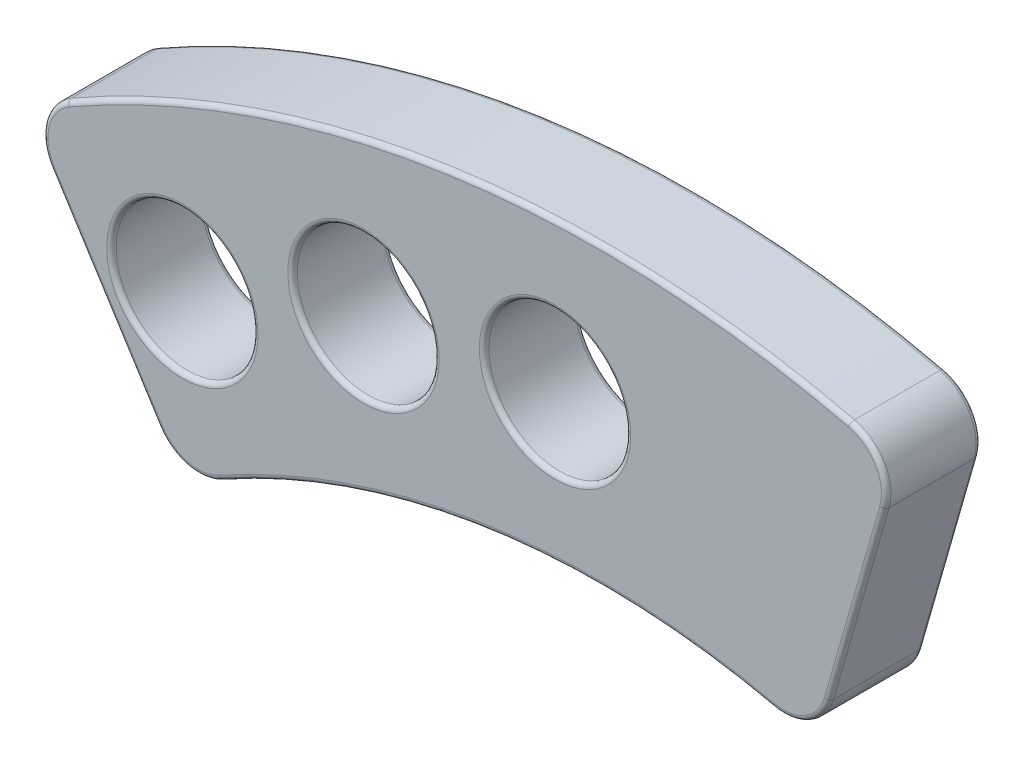
ISO-10303-21;
HEADER;
FILE_DESCRIPTION(('STEP AP214'),'2;1');
FILE_NAME('part.step','',(''),(''),'','','');
FILE_SCHEMA(('AUTOMOTIVE_DESIGN { 1 0 10303 214 1 1 1 1 }'));
ENDSEC;
DATA;
#1=APPLICATION_CONTEXT('core data for automotive mechanical design processes');
#2=APPLICATION_PROTOCOL_DEFINITION('international standard','automotive_design',2000,#1);
#3=PRODUCT_CONTEXT('',#1,'mechanical');
#4=PRODUCT('Part','Part','',(#3));
#5=PRODUCT_RELATED_PRODUCT_CATEGORY('part','',(#4));
#6=PRODUCT_DEFINITION_FORMATION('','',#4);
#7=PRODUCT_DEFINITION_CONTEXT('part definition',#1,'design');
#8=PRODUCT_DEFINITION('design','',#6,#7);
#9=PRODUCT_DEFINITION_SHAPE('','',#8);
#10=(LENGTH_UNIT() NAMED_UNIT(*) SI_UNIT(.MILLI.,.METRE.));
#11=(NAMED_UNIT(*) PLANE_ANGLE_UNIT() SI_UNIT($,.RADIAN.));
#12=(NAMED_UNIT(*) SI_UNIT($,.STERADIAN.) SOLID_ANGLE_UNIT());
#13=UNCERTAINTY_MEASURE_WITH_UNIT(LENGTH_MEASURE(1.E-05),#10,'distance_accuracy_value','');
#14=(GEOMETRIC_REPRESENTATION_CONTEXT(3) GLOBAL_UNCERTAINTY_ASSIGNED_CONTEXT((#13)) GLOBAL_UNIT_ASSIGNED_CONTEXT((#10,
#11,#12)) REPRESENTATION_CONTEXT('',''));
#15=CARTESIAN_POINT('',(0.,0.,0.));
#16=DIRECTION('',(0.,0.,1.));
#17=DIRECTION('',(1.,0.,0.));
#18=AXIS2_PLACEMENT_3D('',#15,#16,#17);
#19=CARTESIAN_POINT('',(0.,0.,4.));
#20=DIRECTION('',(-0.961340958485753,0.275360784313404,0.));
#21=DIRECTION('',(-0.275360784313404,-0.961340958485753,0.));
#22=AXIS2_PLACEMENT_3D('',#19,#20,#21);
#23=PLANE('',#22);
#24=DIRECTION('',(0.,0.,-1.));
#25=VECTOR('',#24,1.);
#26=CARTESIAN_POINT('',(11.9665954579187,41.7778383948582,4.));
#27=LINE('',#26,#25);
#28=CARTESIAN_POINT('',(11.9665954579187,41.7778383948582,3.8));
#29=VERTEX_POINT('',#28);
#30=CARTESIAN_POINT('',(11.9665954579187,41.7778383948582,0.2));
#31=VERTEX_POINT('',#30);
#32=EDGE_CURVE('E321',#29,#31,#27,.T.);
#33=ORIENTED_EDGE('',*,*,#32,.F.);
#34=DIRECTION('',(0.275360784313404,0.961340958485753,0.));
#35=VECTOR('',#34,1.);
#36=CARTESIAN_POINT('',(9.62294157756633,33.5956621517354,3.8));
#37=LINE('',#36,#35);
#38=CARTESIAN_POINT('',(9.62294157756633,33.5956621517354,3.8));
#39=VERTEX_POINT('',#38);
#40=EDGE_CURVE('E212',#29,#39,#37,.F.);
#41=ORIENTED_EDGE('',*,*,#40,.T.);
#42=DIRECTION('',(0.,0.,-1.));
#43=VECTOR('',#42,1.);
#44=CARTESIAN_POINT('',(9.62294157756633,33.5956621517354,4.));
#45=LINE('',#44,#43);
#46=CARTESIAN_POINT('',(9.62294157756633,33.5956621517354,0.2));
#47=VERTEX_POINT('',#46);
#48=EDGE_CURVE('E270',#39,#47,#45,.T.);
#49=ORIENTED_EDGE('',*,*,#48,.T.);
#50=DIRECTION('',(0.275360784313404,0.961340958485753,0.));
#51=VECTOR('',#50,1.);
#52=CARTESIAN_POINT('',(0.,0.,0.2));
#53=LINE('',#52,#51);
#54=EDGE_CURVE('E210',#47,#31,#53,.T.);
#55=ORIENTED_EDGE('',*,*,#54,.T.);
#56=EDGE_LOOP('',(#33,#41,#49,#55));
#57=FACE_BOUND('',#56,.T.);
#58=ADVANCED_FACE('F37',(#57),#23,.F.);
#59=CARTESIAN_POINT('',(10.0439135409472,42.328559963485,4.));
#60=DIRECTION('',(0.,0.,-1.));
#61=DIRECTION('',(-1.,0.,0.));
#62=AXIS2_PLACEMENT_3D('',#59,#60,#61);
#63=CYLINDRICAL_SURFACE('',#62,2.);
#64=DIRECTION('',(0.,0.,-1.));
#65=VECTOR('',#64,1.);
#66=CARTESIAN_POINT('',(10.5056615307137,44.2745272792297,4.));
#67=LINE('',#66,#65);
#68=CARTESIAN_POINT('',(10.5056615307137,44.2745272792297,3.8));
#69=VERTEX_POINT('',#68);
#70=CARTESIAN_POINT('',(10.5056615307137,44.2745272792297,0.2));
#71=VERTEX_POINT('',#70);
#72=EDGE_CURVE('E329',#69,#71,#67,.T.);
#73=ORIENTED_EDGE('',*,*,#72,.F.);
#74=CARTESIAN_POINT('',(10.0439135409472,42.328559963485,3.8));
#75=DIRECTION('',(0.,0.,1.));
#76=DIRECTION('',(1.,0.,0.));
#77=AXIS2_PLACEMENT_3D('',#74,#75,#76);
#78=CIRCLE('',#77,2.);
#79=EDGE_CURVE('E208',#69,#29,#78,.F.);
#80=ORIENTED_EDGE('',*,*,#79,.T.);
#81=ORIENTED_EDGE('',*,*,#32,.T.);
#82=CARTESIAN_POINT('',(10.0439135409472,42.328559963485,0.2));
#83=DIRECTION('',(0.,0.,1.));
#84=DIRECTION('',(1.,0.,0.));
#85=AXIS2_PLACEMENT_3D('',#82,#83,#84);
#86=CIRCLE('',#85,2.);
#87=EDGE_CURVE('E205',#31,#71,#86,.T.);
#88=ORIENTED_EDGE('',*,*,#87,.T.);
#89=EDGE_LOOP('',(#73,#80,#81,#88));
#90=FACE_BOUND('',#89,.T.);
#91=ADVANCED_FACE('F325',(#90),#63,.T.);
#92=CARTESIAN_POINT('',(0.,0.,4.));
#93=DIRECTION('',(0.,0.,-1.));
#94=DIRECTION('',(-1.,0.,0.));
#95=AXIS2_PLACEMENT_3D('',#92,#93,#94);
#96=CYLINDRICAL_SURFACE('',#95,45.503875549201);
#97=DIRECTION('',(0.,0.,-1.));
#98=VECTOR('',#97,1.);
#99=CARTESIAN_POINT('',(-22.5919266784462,39.4994625117649,4.));
#100=LINE('',#99,#98);
#101=CARTESIAN_POINT('',(-22.5919266784462,39.4994625117649,3.8));
#102=VERTEX_POINT('',#101);
#103=CARTESIAN_POINT('',(-22.5919266784462,39.4994625117649,0.2));
#104=VERTEX_POINT('',#103);
#105=EDGE_CURVE('E334',#102,#104,#100,.T.);
#106=ORIENTED_EDGE('',*,*,#105,.F.);
#107=CARTESIAN_POINT('',(0.,0.,3.8));
#108=DIRECTION('',(0.,0.,1.));
#109=DIRECTION('',(1.,0.,0.));
#110=AXIS2_PLACEMENT_3D('',#107,#108,#109);
#111=CIRCLE('',#110,45.503875549201);
#112=EDGE_CURVE('E203',#102,#69,#111,.F.);
#113=ORIENTED_EDGE('',*,*,#112,.T.);
#114=ORIENTED_EDGE('',*,*,#72,.T.);
#115=CARTESIAN_POINT('',(0.,0.,0.2));
#116=DIRECTION('',(0.,0.,1.));
#117=DIRECTION('',(1.,0.,0.));
#118=AXIS2_PLACEMENT_3D('',#115,#116,#117);
#119=CIRCLE('',#118,45.503875549201);
#120=EDGE_CURVE('E201',#71,#104,#119,.T.);
#121=ORIENTED_EDGE('',*,*,#120,.T.);
#122=EDGE_LOOP('',(#106,#113,#114,#121));
#123=FACE_BOUND('',#122,.T.);
#124=ADVANCED_FACE('F411',(#123),#96,.T.);
#125=CARTESIAN_POINT('',(-21.5990457137188,37.7633209881897,4.));
#126=DIRECTION('',(0.,0.,-1.));
#127=DIRECTION('',(-1.,0.,0.));
#128=AXIS2_PLACEMENT_3D('',#125,#126,#127);
#129=CYLINDRICAL_SURFACE('',#128,2.);
#130=DIRECTION('',(0.,0.,-1.));
#131=VECTOR('',#130,1.);
#132=CARTESIAN_POINT('',(-23.2877015647229,36.6916673982318,4.));
#133=LINE('',#132,#131);
#134=CARTESIAN_POINT('',(-23.2877015647229,36.6916673982318,3.8));
#135=VERTEX_POINT('',#134);
#136=CARTESIAN_POINT('',(-23.2877015647229,36.6916673982318,0.2));
#137=VERTEX_POINT('',#136);
#138=EDGE_CURVE('E375',#135,#137,#133,.T.);
#139=ORIENTED_EDGE('',*,*,#138,.F.);
#140=CARTESIAN_POINT('',(-21.5990457137188,37.7633209881897,3.8));
#141=DIRECTION('',(0.,0.,1.));
#142=DIRECTION('',(1.,0.,0.));
#143=AXIS2_PLACEMENT_3D('',#140,#141,#142);
#144=CIRCLE('',#143,2.);
#145=EDGE_CURVE('E199',#135,#102,#144,.F.);
#146=ORIENTED_EDGE('',*,*,#145,.T.);
#147=ORIENTED_EDGE('',*,*,#105,.T.);
#148=CARTESIAN_POINT('',(-21.5990457137188,37.7633209881897,0.2));
#149=DIRECTION('',(0.,0.,1.));
#150=DIRECTION('',(1.,0.,0.));
#151=AXIS2_PLACEMENT_3D('',#148,#149,#150);
#152=CIRCLE('',#151,2.);
#153=EDGE_CURVE('E197',#104,#137,#152,.T.);
#154=ORIENTED_EDGE('',*,*,#153,.T.);
#155=EDGE_LOOP('',(#139,#146,#147,#154));
#156=FACE_BOUND('',#155,.T.);
#157=ADVANCED_FACE('F382',(#156),#129,.T.);
#158=CARTESIAN_POINT('',(-0.00175468856194452,-0.00111355922258998,4.));
#159=DIRECTION('',(-0.844327925502016,-0.535826794978996,0.));
#160=DIRECTION('',(0.535826794978996,-0.844327925502016,0.));
#161=AXIS2_PLACEMENT_3D('',#158,#159,#160);
#162=PLANE('',#161);
#163=DIRECTION('',(0.,0.,-1.));
#164=VECTOR('',#163,1.);
#165=CARTESIAN_POINT('',(-18.7271788454364,29.5054334829776,4.));
#166=LINE('',#165,#164);
#167=CARTESIAN_POINT('',(-18.7271788454364,29.5054334829776,3.8));
#168=VERTEX_POINT('',#167);
#169=CARTESIAN_POINT('',(-18.7271788454364,29.5054334829776,0.2));
#170=VERTEX_POINT('',#169);
#171=EDGE_CURVE('E369',#168,#170,#166,.T.);
#172=ORIENTED_EDGE('',*,*,#171,.F.);
#173=DIRECTION('',(-0.535826794978996,0.844327925502016,0.));
#174=VECTOR('',#173,1.);
#175=CARTESIAN_POINT('',(-0.00175468856194452,-0.00111355922258998,3.8));
#176=LINE('',#175,#174);
#177=EDGE_CURVE('E195',#168,#135,#176,.T.);
#178=ORIENTED_EDGE('',*,*,#177,.T.);
#179=ORIENTED_EDGE('',*,*,#138,.T.);
#180=DIRECTION('',(-0.535826794978996,0.844327925502016,0.));
#181=VECTOR('',#180,1.);
#182=CARTESIAN_POINT('',(-18.7271788454364,29.5054334829776,0.2));
#183=LINE('',#182,#181);
#184=EDGE_CURVE('E193',#137,#170,#183,.F.);
#185=ORIENTED_EDGE('',*,*,#184,.T.);
#186=EDGE_LOOP('',(#172,#178,#179,#185));
#187=FACE_BOUND('',#186,.T.);
#188=ADVANCED_FACE('F489',(#187),#162,.T.);
#189=CARTESIAN_POINT('',(-17.0385229944323,30.5770870729356,4.));
#190=DIRECTION('',(0.,0.,-1.));
#191=DIRECTION('',(-1.,0.,0.));
#192=AXIS2_PLACEMENT_3D('',#189,#190,#191);
#193=CYLINDRICAL_SURFACE('',#192,2.);
#194=DIRECTION('',(0.,0.,-1.));
#195=VECTOR('',#194,1.);
#196=CARTESIAN_POINT('',(-16.0651150936589,28.8299531173638,4.));
#197=LINE('',#196,#195);
#198=CARTESIAN_POINT('',(-16.0651150936589,28.8299531173638,3.8));
#199=VERTEX_POINT('',#198);
#200=CARTESIAN_POINT('',(-16.0651150936589,28.8299531173638,0.2));
#201=VERTEX_POINT('',#200);
#202=EDGE_CURVE('E367',#199,#201,#197,.T.);
#203=ORIENTED_EDGE('',*,*,#202,.F.);
#204=CARTESIAN_POINT('',(-17.0385229944323,30.5770870729356,3.8));
#205=DIRECTION('',(0.,0.,1.));
#206=DIRECTION('',(1.,0.,0.));
#207=AXIS2_PLACEMENT_3D('',#204,#205,#206);
#208=CIRCLE('',#207,2.);
#209=EDGE_CURVE('E191',#199,#168,#208,.F.);
#210=ORIENTED_EDGE('',*,*,#209,.T.);
#211=ORIENTED_EDGE('',*,*,#171,.T.);
#212=CARTESIAN_POINT('',(-17.0385229944323,30.5770870729356,0.2));
#213=DIRECTION('',(0.,0.,1.));
#214=DIRECTION('',(1.,0.,0.));
#215=AXIS2_PLACEMENT_3D('',#212,#213,#214);
#216=CIRCLE('',#215,2.);
#217=EDGE_CURVE('E189',#170,#201,#216,.T.);
#218=ORIENTED_EDGE('',*,*,#217,.T.);
#219=EDGE_LOOP('',(#203,#210,#211,#218));
#220=FACE_BOUND('',#219,.T.);
#221=ADVANCED_FACE('F486',(#220),#193,.T.);
#222=CARTESIAN_POINT('',(0.,0.,4.));
#223=DIRECTION('',(0.,0.,-1.));
#224=DIRECTION('',(-1.,0.,0.));
#225=AXIS2_PLACEMENT_3D('',#222,#223,#224);
#226=CYLINDRICAL_SURFACE('',#225,33.0038500742247);
#227=DIRECTION('',(0.,0.,-1.));
#228=VECTOR('',#227,1.);
#229=CARTESIAN_POINT('',(7.26029322008805,32.1953764084262,4.));
#230=LINE('',#229,#228);
#231=CARTESIAN_POINT('',(7.26029322008805,32.1953764084262,3.8));
#232=VERTEX_POINT('',#231);
#233=CARTESIAN_POINT('',(7.26029322008805,32.1953764084262,0.2));
#234=VERTEX_POINT('',#233);
#235=EDGE_CURVE('E365',#232,#234,#230,.T.);
#236=ORIENTED_EDGE('',*,*,#235,.F.);
#237=CARTESIAN_POINT('',(0.,0.,3.8));
#238=DIRECTION('',(0.,0.,1.));
#239=DIRECTION('',(1.,0.,0.));
#240=AXIS2_PLACEMENT_3D('',#237,#238,#239);
#241=CIRCLE('',#240,33.0038500742247);
#242=EDGE_CURVE('E187',#232,#199,#241,.T.);
#243=ORIENTED_EDGE('',*,*,#242,.T.);
#244=ORIENTED_EDGE('',*,*,#202,.T.);
#245=CARTESIAN_POINT('',(0.,0.,0.2));
#246=DIRECTION('',(0.,0.,1.));
#247=DIRECTION('',(1.,0.,0.));
#248=AXIS2_PLACEMENT_3D('',#245,#246,#247);
#249=CIRCLE('',#248,33.0038500742247);
#250=EDGE_CURVE('E185',#201,#234,#249,.F.);
#251=ORIENTED_EDGE('',*,*,#250,.T.);
#252=EDGE_LOOP('',(#236,#243,#244,#251));
#253=FACE_BOUND('',#252,.T.);
#254=ADVANCED_FACE('F366',(#253),#226,.F.);
#255=CARTESIAN_POINT('',(-17.7126467123084,34.9725652470395,4.));
#256=DIRECTION('',(0.,0.,-1.));
#257=DIRECTION('',(-1.,0.,0.));
#258=AXIS2_PLACEMENT_3D('',#255,#256,#257);
#259=CYLINDRICAL_SURFACE('',#258,3.);
#260=CARTESIAN_POINT('',(-17.7126467123084,34.9725652470395,3.8));
#261=DIRECTION('',(0.,0.,1.));
#262=DIRECTION('',(1.,0.,0.));
#263=AXIS2_PLACEMENT_3D('',#260,#261,#262);
#264=CIRCLE('',#263,3.);
#265=CARTESIAN_POINT('',(-14.7126467123084,34.9725652470395,3.8));
#266=VERTEX_POINT('',#265);
#267=EDGE_CURVE('E217',#266,#266,#264,.T.);
#268=ORIENTED_EDGE('',*,*,#267,.T.);
#269=EDGE_LOOP('',(#268));
#270=FACE_BOUND('',#269,.T.);
#271=CARTESIAN_POINT('',(-17.7126467123084,34.9725652470395,0.2));
#272=DIRECTION('',(0.,0.,1.));
#273=DIRECTION('',(1.,0.,0.));
#274=AXIS2_PLACEMENT_3D('',#271,#272,#273);
#275=CIRCLE('',#274,3.);
#276=CARTESIAN_POINT('',(-14.7126467123084,34.9725652470395,0.2));
#277=VERTEX_POINT('',#276);
#278=EDGE_CURVE('E214',#277,#277,#275,.F.);
#279=ORIENTED_EDGE('',*,*,#278,.T.);
#280=EDGE_LOOP('',(#279));
#281=FACE_BOUND('',#280,.T.);
#282=ADVANCED_FACE('F415',(#270,#281),#259,.F.);
#283=CARTESIAN_POINT('',(-10.054377711544,37.8909971147134,4.));
#284=DIRECTION('',(0.,0.,-1.));
#285=DIRECTION('',(-1.,0.,0.));
#286=AXIS2_PLACEMENT_3D('',#283,#284,#285);
#287=CYLINDRICAL_SURFACE('',#286,3.00000000000027);
#288=CARTESIAN_POINT('',(-10.054377711544,37.8909971147134,3.8));
#289=DIRECTION('',(0.,0.,1.));
#290=DIRECTION('',(1.,0.,0.));
#291=AXIS2_PLACEMENT_3D('',#288,#289,#290);
#292=CIRCLE('',#291,3.00000000000027);
#293=CARTESIAN_POINT('',(-7.05437771154368,37.8909971147134,3.8));
#294=VERTEX_POINT('',#293);
#295=EDGE_CURVE('E223',#294,#294,#292,.T.);
#296=ORIENTED_EDGE('',*,*,#295,.T.);
#297=EDGE_LOOP('',(#296));
#298=FACE_BOUND('',#297,.T.);
#299=CARTESIAN_POINT('',(-10.054377711544,37.8909971147134,0.2));
#300=DIRECTION('',(0.,0.,1.));
#301=DIRECTION('',(1.,0.,0.));
#302=AXIS2_PLACEMENT_3D('',#299,#300,#301);
#303=CIRCLE('',#302,3.00000000000027);
#304=CARTESIAN_POINT('',(-7.05437771154368,37.8909971147134,0.2));
#305=VERTEX_POINT('',#304);
#306=EDGE_CURVE('E220',#305,#305,#303,.F.);
#307=ORIENTED_EDGE('',*,*,#306,.T.);
#308=EDGE_LOOP('',(#307));
#309=FACE_BOUND('',#308,.T.);
#310=ADVANCED_FACE('F418',(#298,#309),#287,.F.);
#311=CARTESIAN_POINT('',(-1.95668415852767,39.1534105872975,4.));
#312=DIRECTION('',(0.,0.,-1.));
#313=DIRECTION('',(-1.,0.,0.));
#314=AXIS2_PLACEMENT_3D('',#311,#312,#313);
#315=CYLINDRICAL_SURFACE('',#314,3.00000000000087);
#316=CARTESIAN_POINT('',(-1.95668415852767,39.1534105872975,3.8));
#317=DIRECTION('',(0.,0.,1.));
#318=DIRECTION('',(1.,0.,0.));
#319=AXIS2_PLACEMENT_3D('',#316,#317,#318);
#320=CIRCLE('',#319,3.00000000000087);
#321=CARTESIAN_POINT('',(1.0433158414732,39.1534105872975,3.8));
#322=VERTEX_POINT('',#321);
#323=EDGE_CURVE('E229',#322,#322,#320,.T.);
#324=ORIENTED_EDGE('',*,*,#323,.T.);
#325=EDGE_LOOP('',(#324));
#326=FACE_BOUND('',#325,.T.);
#327=CARTESIAN_POINT('',(-1.95668415852767,39.1534105872975,0.2));
#328=DIRECTION('',(0.,0.,1.));
#329=DIRECTION('',(1.,0.,0.));
#330=AXIS2_PLACEMENT_3D('',#327,#328,#329);
#331=CIRCLE('',#330,3.00000000000087);
#332=CARTESIAN_POINT('',(1.0433158414732,39.1534105872975,0.2));
#333=VERTEX_POINT('',#332);
#334=EDGE_CURVE('E226',#333,#333,#331,.F.);
#335=ORIENTED_EDGE('',*,*,#334,.T.);
#336=EDGE_LOOP('',(#335));
#337=FACE_BOUND('',#336,.T.);
#338=ADVANCED_FACE('F422',(#326,#337),#315,.F.);
#339=CARTESIAN_POINT('',(7.70025966059482,34.1463837203622,4.));
#340=DIRECTION('',(0.,0.,-1.));
#341=DIRECTION('',(-1.,0.,0.));
#342=AXIS2_PLACEMENT_3D('',#339,#340,#341);
#343=CYLINDRICAL_SURFACE('',#342,2.);
#344=ORIENTED_EDGE('',*,*,#48,.F.);
#345=CARTESIAN_POINT('',(7.70025966059482,34.1463837203622,3.8));
#346=DIRECTION('',(0.,0.,1.));
#347=DIRECTION('',(1.,0.,0.));
#348=AXIS2_PLACEMENT_3D('',#345,#346,#347);
#349=CIRCLE('',#348,2.);
#350=EDGE_CURVE('E157',#39,#232,#349,.F.);
#351=ORIENTED_EDGE('',*,*,#350,.T.);
#352=ORIENTED_EDGE('',*,*,#235,.T.);
#353=CARTESIAN_POINT('',(7.70025966059482,34.1463837203622,0.2));
#354=DIRECTION('',(0.,0.,1.));
#355=DIRECTION('',(1.,0.,0.));
#356=AXIS2_PLACEMENT_3D('',#353,#354,#355);
#357=CIRCLE('',#356,2.);
#358=EDGE_CURVE('E177',#234,#47,#357,.T.);
#359=ORIENTED_EDGE('',*,*,#358,.T.);
#360=EDGE_LOOP('',(#344,#351,#352,#359));
#361=FACE_BOUND('',#360,.T.);
#362=ADVANCED_FACE('F364',(#361),#343,.T.);
#363=CARTESIAN_POINT('',(0.,0.,4.));
#364=DIRECTION('',(0.,0.,1.));
#365=DIRECTION('',(1.,0.,0.));
#366=AXIS2_PLACEMENT_3D('',#363,#364,#365);
#367=PLANE('',#366);
#368=CARTESIAN_POINT('',(0.,0.,4.));
#369=DIRECTION('',(0.,0.,1.));
#370=DIRECTION('',(1.,0.,0.));
#371=AXIS2_PLACEMENT_3D('',#368,#369,#370);
#372=CIRCLE('',#371,33.2038500742247);
#373=CARTESIAN_POINT('',(-16.1624680697568,29.0046597235958,4.));
#374=VERTEX_POINT('',#373);
#375=CARTESIAN_POINT('',(7.30428986413872,32.3904771396198,4.));
#376=VERTEX_POINT('',#375);
#377=EDGE_CURVE('E175',#374,#376,#372,.F.);
#378=ORIENTED_EDGE('',*,*,#377,.T.);
#379=CARTESIAN_POINT('',(7.70025966059482,34.1463837203622,4.));
#380=DIRECTION('',(0.,0.,1.));
#381=DIRECTION('',(1.,0.,0.));
#382=AXIS2_PLACEMENT_3D('',#379,#380,#381);
#383=CIRCLE('',#382,1.8);
#384=CARTESIAN_POINT('',(9.43067338586918,33.6507343085981,4.));
#385=VERTEX_POINT('',#384);
#386=EDGE_CURVE('E155',#376,#385,#383,.T.);
#387=ORIENTED_EDGE('',*,*,#386,.T.);
#388=DIRECTION('',(0.275360784313404,0.961340958485753,0.));
#389=VECTOR('',#388,1.);
#390=CARTESIAN_POINT('',(11.7743272662215,41.8329105517209,4.));
#391=LINE('',#390,#389);
#392=CARTESIAN_POINT('',(11.7743272662215,41.8329105517209,4.));
#393=VERTEX_POINT('',#392);
#394=EDGE_CURVE('E163',#385,#393,#391,.T.);
#395=ORIENTED_EDGE('',*,*,#394,.T.);
#396=CARTESIAN_POINT('',(10.0439135409472,42.328559963485,4.));
#397=DIRECTION('',(0.,0.,1.));
#398=DIRECTION('',(1.,0.,0.));
#399=AXIS2_PLACEMENT_3D('',#396,#397,#398);
#400=CIRCLE('',#399,1.8);
#401=CARTESIAN_POINT('',(10.459486731737,44.0799305476552,4.));
#402=VERTEX_POINT('',#401);
#403=EDGE_CURVE('E169',#393,#402,#400,.T.);
#404=ORIENTED_EDGE('',*,*,#403,.T.);
#405=CARTESIAN_POINT('',(0.,0.,4.));
#406=DIRECTION('',(0.,0.,1.));
#407=DIRECTION('',(1.,0.,0.));
#408=AXIS2_PLACEMENT_3D('',#405,#406,#407);
#409=CIRCLE('',#408,45.303875549201);
#410=CARTESIAN_POINT('',(-22.4926385831302,39.3258483614298,4.));
#411=VERTEX_POINT('',#410);
#412=EDGE_CURVE('E343',#402,#411,#409,.T.);
#413=ORIENTED_EDGE('',*,*,#412,.T.);
#414=CARTESIAN_POINT('',(-21.5990457137188,37.7633209881897,4.));
#415=DIRECTION('',(0.,0.,1.));
#416=DIRECTION('',(1.,0.,0.));
#417=AXIS2_PLACEMENT_3D('',#414,#415,#416);
#418=CIRCLE('',#417,1.8);
#419=CARTESIAN_POINT('',(-23.1188359796225,36.7988327572276,4.));
#420=VERTEX_POINT('',#419);
#421=EDGE_CURVE('E345',#411,#420,#418,.T.);
#422=ORIENTED_EDGE('',*,*,#421,.T.);
#423=DIRECTION('',(-0.535826794978996,0.844327925502016,0.));
#424=VECTOR('',#423,1.);
#425=CARTESIAN_POINT('',(0.16711089653846,0.10605179977321,4.));
#426=LINE('',#425,#424);
#427=CARTESIAN_POINT('',(-18.558313260336,29.6125988419734,4.));
#428=VERTEX_POINT('',#427);
#429=EDGE_CURVE('E347',#420,#428,#426,.F.);
#430=ORIENTED_EDGE('',*,*,#429,.T.);
#431=CARTESIAN_POINT('',(-17.0385229944323,30.5770870729356,4.));
#432=DIRECTION('',(0.,0.,1.));
#433=DIRECTION('',(1.,0.,0.));
#434=AXIS2_PLACEMENT_3D('',#431,#432,#433);
#435=CIRCLE('',#434,1.8);
#436=EDGE_CURVE('E180',#428,#374,#435,.T.);
#437=ORIENTED_EDGE('',*,*,#436,.T.);
#438=EDGE_LOOP('',(#378,#387,#395,#404,#413,#422,#430,#437));
#439=FACE_BOUND('',#438,.T.);
#440=CARTESIAN_POINT('',(-17.7126467123084,34.9725652470395,4.));
#441=DIRECTION('',(0.,0.,1.));
#442=DIRECTION('',(1.,0.,0.));
#443=AXIS2_PLACEMENT_3D('',#440,#441,#442);
#444=CIRCLE('',#443,3.2);
#445=CARTESIAN_POINT('',(-14.5126467123084,34.9725652470395,4.));
#446=VERTEX_POINT('',#445);
#447=EDGE_CURVE('E170',#446,#446,#444,.F.);
#448=ORIENTED_EDGE('',*,*,#447,.T.);
#449=EDGE_LOOP('',(#448));
#450=FACE_BOUND('',#449,.T.);
#451=CARTESIAN_POINT('',(-10.054377711544,37.8909971147134,4.));
#452=DIRECTION('',(0.,0.,1.));
#453=DIRECTION('',(1.,0.,0.));
#454=AXIS2_PLACEMENT_3D('',#451,#452,#453);
#455=CIRCLE('',#454,3.20000000000027);
#456=CARTESIAN_POINT('',(-6.85437771154368,37.8909971147134,4.));
#457=VERTEX_POINT('',#456);
#458=EDGE_CURVE('E332',#457,#457,#455,.F.);
#459=ORIENTED_EDGE('',*,*,#458,.T.);
#460=EDGE_LOOP('',(#459));
#461=FACE_BOUND('',#460,.T.);
#462=CARTESIAN_POINT('',(-1.95668415852767,39.1534105872975,4.));
#463=DIRECTION('',(0.,0.,1.));
#464=DIRECTION('',(1.,0.,0.));
#465=AXIS2_PLACEMENT_3D('',#462,#463,#464);
#466=CIRCLE('',#465,3.20000000000087);
#467=CARTESIAN_POINT('',(1.2433158414732,39.1534105872975,4.));
#468=VERTEX_POINT('',#467);
#469=EDGE_CURVE('E328',#468,#468,#466,.F.);
#470=ORIENTED_EDGE('',*,*,#469,.T.);
#471=EDGE_LOOP('',(#470));
#472=FACE_BOUND('',#471,.T.);
#473=ADVANCED_FACE('F172',(#439,#450,#461,#472),#367,.T.);
#474=CARTESIAN_POINT('',(0.,0.,0.));
#475=DIRECTION('',(0.,0.,1.));
#476=DIRECTION('',(1.,0.,0.));
#477=AXIS2_PLACEMENT_3D('',#474,#475,#476);
#478=PLANE('',#477);
#479=CARTESIAN_POINT('',(0.,0.,0.));
#480=DIRECTION('',(0.,0.,1.));
#481=DIRECTION('',(1.,0.,0.));
#482=AXIS2_PLACEMENT_3D('',#479,#480,#481);
#483=CIRCLE('',#482,45.303875549201);
#484=CARTESIAN_POINT('',(-22.4926299638787,39.3258532879731,0.));
#485=VERTEX_POINT('',#484);
#486=CARTESIAN_POINT('',(10.459486731737,44.0799305476552,0.));
#487=VERTEX_POINT('',#486);
#488=EDGE_CURVE('E46',#485,#487,#483,.F.);
#489=ORIENTED_EDGE('',*,*,#488,.T.);
#490=CARTESIAN_POINT('',(10.0439135409472,42.328559963485,0.));
#491=DIRECTION('',(0.,0.,1.));
#492=DIRECTION('',(1.,0.,0.));
#493=AXIS2_PLACEMENT_3D('',#490,#491,#492);
#494=CIRCLE('',#493,1.8);
#495=CARTESIAN_POINT('',(11.7743272662215,41.8329105517209,0.));
#496=VERTEX_POINT('',#495);
#497=EDGE_CURVE('E11',#487,#496,#494,.F.);
#498=ORIENTED_EDGE('',*,*,#497,.T.);
#499=DIRECTION('',(0.275360784313404,0.961340958485753,0.));
#500=VECTOR('',#499,1.);
#501=CARTESIAN_POINT('',(-0.19226819169715,0.0550721568626806,0.));
#502=LINE('',#501,#500);
#503=CARTESIAN_POINT('',(9.43067338586918,33.6507343085981,0.));
#504=VERTEX_POINT('',#503);
#505=EDGE_CURVE('E241',#496,#504,#502,.F.);
#506=ORIENTED_EDGE('',*,*,#505,.T.);
#507=CARTESIAN_POINT('',(7.70025966059482,34.1463837203622,0.));
#508=DIRECTION('',(0.,0.,1.));
#509=DIRECTION('',(1.,0.,0.));
#510=AXIS2_PLACEMENT_3D('',#507,#508,#509);
#511=CIRCLE('',#510,1.8);
#512=CARTESIAN_POINT('',(7.30428986413872,32.3904771396198,0.));
#513=VERTEX_POINT('',#512);
#514=EDGE_CURVE('E243',#504,#513,#511,.F.);
#515=ORIENTED_EDGE('',*,*,#514,.T.);
#516=CARTESIAN_POINT('',(0.,0.,0.));
#517=DIRECTION('',(0.,0.,1.));
#518=DIRECTION('',(1.,0.,0.));
#519=AXIS2_PLACEMENT_3D('',#516,#517,#518);
#520=CIRCLE('',#519,33.2038500742247);
#521=CARTESIAN_POINT('',(-16.1624558839716,29.0046665133434,0.));
#522=VERTEX_POINT('',#521);
#523=EDGE_CURVE('E245',#513,#522,#520,.T.);
#524=ORIENTED_EDGE('',*,*,#523,.T.);
#525=CARTESIAN_POINT('',(-17.0385229944323,30.5770870729356,0.));
#526=DIRECTION('',(0.,0.,1.));
#527=DIRECTION('',(1.,0.,0.));
#528=AXIS2_PLACEMENT_3D('',#525,#526,#527);
#529=CIRCLE('',#528,1.8);
#530=CARTESIAN_POINT('',(-18.558313260336,29.6125988419734,0.));
#531=VERTEX_POINT('',#530);
#532=EDGE_CURVE('E247',#522,#531,#529,.F.);
#533=ORIENTED_EDGE('',*,*,#532,.T.);
#534=DIRECTION('',(-0.535826794978996,0.844327925502016,0.));
#535=VECTOR('',#534,1.);
#536=CARTESIAN_POINT('',(-23.1188359796225,36.7988327572276,0.));
#537=LINE('',#536,#535);
#538=CARTESIAN_POINT('',(-23.1188359796225,36.7988327572276,0.));
#539=VERTEX_POINT('',#538);
#540=EDGE_CURVE('E249',#531,#539,#537,.T.);
#541=ORIENTED_EDGE('',*,*,#540,.T.);
#542=CARTESIAN_POINT('',(-21.5990457137188,37.7633209881897,0.));
#543=DIRECTION('',(0.,0.,1.));
#544=DIRECTION('',(1.,0.,0.));
#545=AXIS2_PLACEMENT_3D('',#542,#543,#544);
#546=CIRCLE('',#545,1.8);
#547=EDGE_CURVE('E57',#539,#485,#546,.F.);
#548=ORIENTED_EDGE('',*,*,#547,.T.);
#549=EDGE_LOOP('',(#489,#498,#506,#515,#524,#533,#541,#548));
#550=FACE_BOUND('',#549,.T.);
#551=CARTESIAN_POINT('',(-17.7126467123084,34.9725652470395,0.));
#552=DIRECTION('',(0.,0.,1.));
#553=DIRECTION('',(1.,0.,0.));
#554=AXIS2_PLACEMENT_3D('',#551,#552,#553);
#555=CIRCLE('',#554,3.2);
#556=CARTESIAN_POINT('',(-14.5126467123084,34.9725652470395,0.));
#557=VERTEX_POINT('',#556);
#558=EDGE_CURVE('E238',#557,#557,#555,.T.);
#559=ORIENTED_EDGE('',*,*,#558,.T.);
#560=EDGE_LOOP('',(#559));
#561=FACE_BOUND('',#560,.T.);
#562=CARTESIAN_POINT('',(-10.054377711544,37.8909971147134,0.));
#563=DIRECTION('',(0.,0.,1.));
#564=DIRECTION('',(1.,0.,0.));
#565=AXIS2_PLACEMENT_3D('',#562,#563,#564);
#566=CIRCLE('',#565,3.20000000000027);
#567=CARTESIAN_POINT('',(-6.85437771154368,37.8909971147134,0.));
#568=VERTEX_POINT('',#567);
#569=EDGE_CURVE('E235',#568,#568,#566,.T.);
#570=ORIENTED_EDGE('',*,*,#569,.T.);
#571=EDGE_LOOP('',(#570));
#572=FACE_BOUND('',#571,.T.);
#573=CARTESIAN_POINT('',(-1.95668415852767,39.1534105872975,0.));
#574=DIRECTION('',(0.,0.,1.));
#575=DIRECTION('',(1.,0.,0.));
#576=AXIS2_PLACEMENT_3D('',#573,#574,#575);
#577=CIRCLE('',#576,3.20000000000087);
#578=CARTESIAN_POINT('',(1.2433158414732,39.1534105872975,0.));
#579=VERTEX_POINT('',#578);
#580=EDGE_CURVE('E232',#579,#579,#577,.T.);
#581=ORIENTED_EDGE('',*,*,#580,.T.);
#582=EDGE_LOOP('',(#581));
#583=FACE_BOUND('',#582,.T.);
#584=ADVANCED_FACE('F303',(#550,#561,#572,#583),#478,.F.);
#585=CARTESIAN_POINT('',(-21.5990457137188,37.7633209881897,3.8));
#586=DIRECTION('',(0.,0.,1.));
#587=DIRECTION('',(1.,0.,0.));
#588=AXIS2_PLACEMENT_3D('',#585,#586,#587);
#589=TOROIDAL_SURFACE('',#588,1.8,0.2);
#590=CARTESIAN_POINT('',(-22.4926385819735,39.3258483594074,3.8));
#591=DIRECTION('',(0.868070761787589,0.496440482363712,0.));
#592=DIRECTION('',(-0.496440482363712,0.868070761787589,0.));
#593=AXIS2_PLACEMENT_3D('',#590,#591,#592);
#594=CIRCLE('',#593,0.2);
#595=EDGE_CURVE('E264',#102,#411,#594,.T.);
#596=ORIENTED_EDGE('',*,*,#595,.F.);
#597=ORIENTED_EDGE('',*,*,#145,.F.);
#598=CARTESIAN_POINT('',(-23.1188359796225,36.7988327572276,3.8));
#599=DIRECTION('',(0.535826794978991,-0.844327925502019,0.));
#600=DIRECTION('',(0.844327925502019,0.535826794978991,0.));
#601=AXIS2_PLACEMENT_3D('',#598,#599,#600);
#602=CIRCLE('',#601,0.2);
#603=EDGE_CURVE('E267',#420,#135,#602,.T.);
#604=ORIENTED_EDGE('',*,*,#603,.F.);
#605=ORIENTED_EDGE('',*,*,#421,.F.);
#606=EDGE_LOOP('',(#596,#597,#604,#605));
#607=FACE_BOUND('',#606,.T.);
#608=ADVANCED_FACE('F447',(#607),#589,.T.);
#609=CARTESIAN_POINT('',(0.167110896538459,0.106051799773209,3.8));
#610=DIRECTION('',(-0.535826794978996,0.844327925502016,0.));
#611=DIRECTION('',(-0.844327925502016,-0.535826794978996,0.));
#612=AXIS2_PLACEMENT_3D('',#609,#610,#611);
#613=CYLINDRICAL_SURFACE('',#612,0.2);
#614=ORIENTED_EDGE('',*,*,#603,.T.);
#615=ORIENTED_EDGE('',*,*,#177,.F.);
#616=CARTESIAN_POINT('',(-18.558313260336,29.6125988419734,3.8));
#617=DIRECTION('',(0.535826794978999,-0.844327925502014,0.));
#618=DIRECTION('',(0.844327925502014,0.535826794978999,0.));
#619=AXIS2_PLACEMENT_3D('',#616,#617,#618);
#620=CIRCLE('',#619,0.2);
#621=EDGE_CURVE('E261',#428,#168,#620,.T.);
#622=ORIENTED_EDGE('',*,*,#621,.F.);
#623=ORIENTED_EDGE('',*,*,#429,.F.);
#624=EDGE_LOOP('',(#614,#615,#622,#623));
#625=FACE_BOUND('',#624,.T.);
#626=ADVANCED_FACE('F443',(#625),#613,.T.);
#627=CARTESIAN_POINT('',(0.,0.,3.8));
#628=DIRECTION('',(0.,0.,1.));
#629=DIRECTION('',(1.,0.,0.));
#630=AXIS2_PLACEMENT_3D('',#627,#628,#629);
#631=TOROIDAL_SURFACE('',#630,45.303875549201,0.2);
#632=ORIENTED_EDGE('',*,*,#595,.T.);
#633=ORIENTED_EDGE('',*,*,#412,.F.);
#634=CARTESIAN_POINT('',(10.459486731737,44.0799305476552,3.8));
#635=DIRECTION('',(0.97298365787235,-0.230873994883229,0.));
#636=DIRECTION('',(0.230873994883229,0.97298365787235,0.));
#637=AXIS2_PLACEMENT_3D('',#634,#635,#636);
#638=CIRCLE('',#637,0.2);
#639=EDGE_CURVE('E258',#69,#402,#638,.T.);
#640=ORIENTED_EDGE('',*,*,#639,.F.);
#641=ORIENTED_EDGE('',*,*,#112,.F.);
#642=EDGE_LOOP('',(#632,#633,#640,#641));
#643=FACE_BOUND('',#642,.T.);
#644=ADVANCED_FACE('F440',(#643),#631,.T.);
#645=CARTESIAN_POINT('',(-17.0385229944323,30.5770870729356,3.8));
#646=DIRECTION('',(0.,0.,1.));
#647=DIRECTION('',(1.,0.,0.));
#648=AXIS2_PLACEMENT_3D('',#645,#646,#647);
#649=TOROIDAL_SURFACE('',#648,1.8,0.2);
#650=ORIENTED_EDGE('',*,*,#621,.T.);
#651=ORIENTED_EDGE('',*,*,#209,.F.);
#652=CARTESIAN_POINT('',(-16.1624680697568,29.0046597235958,3.8));
#653=DIRECTION('',(0.873533028799047,0.486764879173882,0.));
#654=DIRECTION('',(-0.486764879173882,0.873533028799047,0.));
#655=AXIS2_PLACEMENT_3D('',#652,#653,#654);
#656=CIRCLE('',#655,0.2);
#657=EDGE_CURVE('E255',#374,#199,#656,.T.);
#658=ORIENTED_EDGE('',*,*,#657,.F.);
#659=ORIENTED_EDGE('',*,*,#436,.F.);
#660=EDGE_LOOP('',(#650,#651,#658,#659));
#661=FACE_BOUND('',#660,.T.);
#662=ADVANCED_FACE('F354',(#661),#649,.T.);
#663=CARTESIAN_POINT('',(10.0439135409472,42.328559963485,3.8));
#664=DIRECTION('',(0.,0.,1.));
#665=DIRECTION('',(1.,0.,0.));
#666=AXIS2_PLACEMENT_3D('',#663,#664,#665);
#667=TOROIDAL_SURFACE('',#666,1.8,0.2);
#668=ORIENTED_EDGE('',*,*,#639,.T.);
#669=ORIENTED_EDGE('',*,*,#403,.F.);
#670=CARTESIAN_POINT('',(11.7743272662215,41.8329105517209,3.8));
#671=DIRECTION('',(-0.275360784313396,-0.961340958485756,0.));
#672=DIRECTION('',(0.961340958485756,-0.275360784313396,0.));
#673=AXIS2_PLACEMENT_3D('',#670,#671,#672);
#674=CIRCLE('',#673,0.2);
#675=EDGE_CURVE('E166',#29,#393,#674,.T.);
#676=ORIENTED_EDGE('',*,*,#675,.F.);
#677=ORIENTED_EDGE('',*,*,#79,.F.);
#678=EDGE_LOOP('',(#668,#669,#676,#677));
#679=FACE_BOUND('',#678,.T.);
#680=ADVANCED_FACE('F434',(#679),#667,.T.);
#681=CARTESIAN_POINT('',(0.,0.,3.8));
#682=DIRECTION('',(0.,0.,1.));
#683=DIRECTION('',(1.,0.,0.));
#684=AXIS2_PLACEMENT_3D('',#681,#682,#683);
#685=TOROIDAL_SURFACE('',#684,33.2038500742247,0.2);
#686=ORIENTED_EDGE('',*,*,#657,.T.);
#687=ORIENTED_EDGE('',*,*,#242,.F.);
#688=CARTESIAN_POINT('',(7.30428986413872,32.3904771396198,3.8));
#689=DIRECTION('',(0.975503655968008,-0.219983220253387,0.));
#690=DIRECTION('',(0.219983220253387,0.975503655968008,0.));
#691=AXIS2_PLACEMENT_3D('',#688,#689,#690);
#692=CIRCLE('',#691,0.2);
#693=EDGE_CURVE('E160',#376,#232,#692,.T.);
#694=ORIENTED_EDGE('',*,*,#693,.F.);
#695=ORIENTED_EDGE('',*,*,#377,.F.);
#696=EDGE_LOOP('',(#686,#687,#694,#695));
#697=FACE_BOUND('',#696,.T.);
#698=ADVANCED_FACE('F357',(#697),#685,.T.);
#699=CARTESIAN_POINT('',(-0.192268191697152,0.0550721568626814,3.8));
#700=DIRECTION('',(-0.275360784313404,-0.961340958485753,0.));
#701=DIRECTION('',(0.961340958485753,-0.275360784313404,0.));
#702=AXIS2_PLACEMENT_3D('',#699,#700,#701);
#703=CYLINDRICAL_SURFACE('',#702,0.2);
#704=ORIENTED_EDGE('',*,*,#675,.T.);
#705=ORIENTED_EDGE('',*,*,#394,.F.);
#706=CARTESIAN_POINT('',(9.43067338586918,33.6507343085981,3.8));
#707=DIRECTION('',(-0.275360784313396,-0.961340958485756,0.));
#708=DIRECTION('',(0.961340958485756,-0.275360784313396,0.));
#709=AXIS2_PLACEMENT_3D('',#706,#707,#708);
#710=CIRCLE('',#709,0.2);
#711=EDGE_CURVE('E151',#39,#385,#710,.T.);
#712=ORIENTED_EDGE('',*,*,#711,.F.);
#713=ORIENTED_EDGE('',*,*,#40,.F.);
#714=EDGE_LOOP('',(#704,#705,#712,#713));
#715=FACE_BOUND('',#714,.T.);
#716=ADVANCED_FACE('F164',(#715),#703,.T.);
#717=CARTESIAN_POINT('',(7.70025966059482,34.1463837203622,3.8));
#718=DIRECTION('',(0.,0.,1.));
#719=DIRECTION('',(1.,0.,0.));
#720=AXIS2_PLACEMENT_3D('',#717,#718,#719);
#721=TOROIDAL_SURFACE('',#720,1.8,0.2);
#722=ORIENTED_EDGE('',*,*,#693,.T.);
#723=ORIENTED_EDGE('',*,*,#350,.F.);
#724=ORIENTED_EDGE('',*,*,#711,.T.);
#725=ORIENTED_EDGE('',*,*,#386,.F.);
#726=EDGE_LOOP('',(#722,#723,#724,#725));
#727=FACE_BOUND('',#726,.T.);
#728=ADVANCED_FACE('F153',(#727),#721,.T.);
#729=CARTESIAN_POINT('',(-17.7126467123084,34.9725652470395,3.8));
#730=DIRECTION('',(0.,0.,1.));
#731=DIRECTION('',(1.,0.,0.));
#732=AXIS2_PLACEMENT_3D('',#729,#730,#731);
#733=TOROIDAL_SURFACE('',#732,3.2,0.2);
#734=ORIENTED_EDGE('',*,*,#447,.F.);
#735=EDGE_LOOP('',(#734));
#736=FACE_BOUND('',#735,.T.);
#737=ORIENTED_EDGE('',*,*,#267,.F.);
#738=EDGE_LOOP('',(#737));
#739=FACE_BOUND('',#738,.T.);
#740=ADVANCED_FACE('F429',(#736,#739),#733,.T.);
#741=CARTESIAN_POINT('',(-10.054377711544,37.8909971147134,3.8));
#742=DIRECTION('',(0.,0.,1.));
#743=DIRECTION('',(1.,0.,0.));
#744=AXIS2_PLACEMENT_3D('',#741,#742,#743);
#745=TOROIDAL_SURFACE('',#744,3.20000000000027,0.2);
#746=ORIENTED_EDGE('',*,*,#458,.F.);
#747=EDGE_LOOP('',(#746));
#748=FACE_BOUND('',#747,.T.);
#749=ORIENTED_EDGE('',*,*,#295,.F.);
#750=EDGE_LOOP('',(#749));
#751=FACE_BOUND('',#750,.T.);
#752=ADVANCED_FACE('F454',(#748,#751),#745,.T.);
#753=CARTESIAN_POINT('',(-1.95668415852767,39.1534105872975,3.8));
#754=DIRECTION('',(0.,0.,1.));
#755=DIRECTION('',(1.,0.,0.));
#756=AXIS2_PLACEMENT_3D('',#753,#754,#755);
#757=TOROIDAL_SURFACE('',#756,3.20000000000087,0.2);
#758=ORIENTED_EDGE('',*,*,#469,.F.);
#759=EDGE_LOOP('',(#758));
#760=FACE_BOUND('',#759,.T.);
#761=ORIENTED_EDGE('',*,*,#323,.F.);
#762=EDGE_LOOP('',(#761));
#763=FACE_BOUND('',#762,.T.);
#764=ADVANCED_FACE('F457',(#760,#763),#757,.T.);
#765=CARTESIAN_POINT('',(-17.0385229944323,30.5770870729356,0.2));
#766=DIRECTION('',(0.,0.,1.));
#767=DIRECTION('',(1.,0.,0.));
#768=AXIS2_PLACEMENT_3D('',#765,#766,#767);
#769=TOROIDAL_SURFACE('',#768,1.8,0.2);
#770=CARTESIAN_POINT('',(-18.558313260336,29.6125988419734,0.2));
#771=DIRECTION('',(-0.535826794978991,0.844327925502018,0.));
#772=DIRECTION('',(-0.844327925502019,-0.535826794978991,0.));
#773=AXIS2_PLACEMENT_3D('',#770,#771,#772);
#774=CIRCLE('',#773,0.2);
#775=EDGE_CURVE('E286',#531,#170,#774,.T.);
#776=ORIENTED_EDGE('',*,*,#775,.F.);
#777=ORIENTED_EDGE('',*,*,#532,.F.);
#778=CARTESIAN_POINT('',(-16.1624558837363,29.004666512921,0.2));
#779=DIRECTION('',(0.873566977785889,0.48670395038671,0.));
#780=DIRECTION('',(-0.48670395038671,0.873566977785889,0.));
#781=AXIS2_PLACEMENT_3D('',#778,#779,#780);
#782=CIRCLE('',#781,0.2);
#783=EDGE_CURVE('E41',#201,#522,#782,.T.);
#784=ORIENTED_EDGE('',*,*,#783,.F.);
#785=ORIENTED_EDGE('',*,*,#217,.F.);
#786=EDGE_LOOP('',(#776,#777,#784,#785));
#787=FACE_BOUND('',#786,.T.);
#788=ADVANCED_FACE('F302',(#787),#769,.T.);
#789=CARTESIAN_POINT('',(0.,0.,0.2));
#790=DIRECTION('',(0.,0.,1.));
#791=DIRECTION('',(1.,0.,0.));
#792=AXIS2_PLACEMENT_3D('',#789,#790,#791);
#793=TOROIDAL_SURFACE('',#792,33.2038500742247,0.2);
#794=ORIENTED_EDGE('',*,*,#783,.T.);
#795=ORIENTED_EDGE('',*,*,#523,.F.);
#796=CARTESIAN_POINT('',(7.30428986413872,32.3904771396198,0.2));
#797=DIRECTION('',(0.975503655968007,-0.219983220253391,0.));
#798=DIRECTION('',(0.219983220253391,0.975503655968007,0.));
#799=AXIS2_PLACEMENT_3D('',#796,#797,#798);
#800=CIRCLE('',#799,0.2);
#801=EDGE_CURVE('E284',#234,#513,#800,.T.);
#802=ORIENTED_EDGE('',*,*,#801,.F.);
#803=ORIENTED_EDGE('',*,*,#250,.F.);
#804=EDGE_LOOP('',(#794,#795,#802,#803));
#805=FACE_BOUND('',#804,.T.);
#806=ADVANCED_FACE('F297',(#805),#793,.T.);
#807=CARTESIAN_POINT('',(0.167110896538459,0.106051799773209,0.2));
#808=DIRECTION('',(0.535826794978996,-0.844327925502016,0.));
#809=DIRECTION('',(0.844327925502016,0.535826794978996,0.));
#810=AXIS2_PLACEMENT_3D('',#807,#808,#809);
#811=CYLINDRICAL_SURFACE('',#810,0.2);
#812=ORIENTED_EDGE('',*,*,#775,.T.);
#813=ORIENTED_EDGE('',*,*,#184,.F.);
#814=CARTESIAN_POINT('',(-23.1188359796225,36.7988327572276,0.2));
#815=DIRECTION('',(-0.535826794978991,0.844327925502018,0.));
#816=DIRECTION('',(-0.844327925502019,-0.535826794978991,0.));
#817=AXIS2_PLACEMENT_3D('',#814,#815,#816);
#818=CIRCLE('',#817,0.2);
#819=EDGE_CURVE('E281',#539,#137,#818,.T.);
#820=ORIENTED_EDGE('',*,*,#819,.F.);
#821=ORIENTED_EDGE('',*,*,#540,.F.);
#822=EDGE_LOOP('',(#812,#813,#820,#821));
#823=FACE_BOUND('',#822,.T.);
#824=ADVANCED_FACE('F619',(#823),#811,.T.);
#825=CARTESIAN_POINT('',(7.70025966059482,34.1463837203622,0.2));
#826=DIRECTION('',(0.,0.,1.));
#827=DIRECTION('',(1.,0.,0.));
#828=AXIS2_PLACEMENT_3D('',#825,#826,#827);
#829=TOROIDAL_SURFACE('',#828,1.8,0.2);
#830=ORIENTED_EDGE('',*,*,#801,.T.);
#831=ORIENTED_EDGE('',*,*,#514,.F.);
#832=CARTESIAN_POINT('',(9.43067338586918,33.6507343085981,0.2));
#833=DIRECTION('',(0.275360784313396,0.961340958485756,0.));
#834=DIRECTION('',(-0.961340958485756,0.275360784313396,0.));
#835=AXIS2_PLACEMENT_3D('',#832,#833,#834);
#836=CIRCLE('',#835,0.2);
#837=EDGE_CURVE('E278',#47,#504,#836,.T.);
#838=ORIENTED_EDGE('',*,*,#837,.F.);
#839=ORIENTED_EDGE('',*,*,#358,.F.);
#840=EDGE_LOOP('',(#830,#831,#838,#839));
#841=FACE_BOUND('',#840,.T.);
#842=ADVANCED_FACE('F310',(#841),#829,.T.);
#843=CARTESIAN_POINT('',(-21.5990457137188,37.7633209881897,0.2));
#844=DIRECTION('',(0.,0.,1.));
#845=DIRECTION('',(1.,0.,0.));
#846=AXIS2_PLACEMENT_3D('',#843,#844,#845);
#847=TOROIDAL_SURFACE('',#846,1.8,0.2);
#848=ORIENTED_EDGE('',*,*,#819,.T.);
#849=ORIENTED_EDGE('',*,*,#153,.F.);
#850=CARTESIAN_POINT('',(-22.4926299638787,39.3258532879731,0.2));
#851=DIRECTION('',(0.868046117770715,0.496483572158425,0.));
#852=DIRECTION('',(-0.496483572158425,0.868046117770715,0.));
#853=AXIS2_PLACEMENT_3D('',#850,#851,#852);
#854=CIRCLE('',#853,0.2);
#855=EDGE_CURVE('E275',#485,#104,#854,.T.);
#856=ORIENTED_EDGE('',*,*,#855,.F.);
#857=ORIENTED_EDGE('',*,*,#547,.F.);
#858=EDGE_LOOP('',(#848,#849,#856,#857));
#859=FACE_BOUND('',#858,.T.);
#860=ADVANCED_FACE('F387',(#859),#847,.T.);
#861=CARTESIAN_POINT('',(-0.192268191697152,0.0550721568626814,0.2));
#862=DIRECTION('',(0.275360784313404,0.961340958485753,0.));
#863=DIRECTION('',(-0.961340958485753,0.275360784313404,0.));
#864=AXIS2_PLACEMENT_3D('',#861,#862,#863);
#865=CYLINDRICAL_SURFACE('',#864,0.2);
#866=ORIENTED_EDGE('',*,*,#837,.T.);
#867=ORIENTED_EDGE('',*,*,#505,.F.);
#868=CARTESIAN_POINT('',(11.7743272662215,41.8329105517209,0.2));
#869=DIRECTION('',(0.275360784313396,0.961340958485756,0.));
#870=DIRECTION('',(-0.961340958485756,0.275360784313396,0.));
#871=AXIS2_PLACEMENT_3D('',#868,#869,#870);
#872=CIRCLE('',#871,0.2);
#873=EDGE_CURVE('E273',#31,#496,#872,.T.);
#874=ORIENTED_EDGE('',*,*,#873,.F.);
#875=ORIENTED_EDGE('',*,*,#54,.F.);
#876=EDGE_LOOP('',(#866,#867,#874,#875));
#877=FACE_BOUND('',#876,.T.);
#878=ADVANCED_FACE('F314',(#877),#865,.T.);
#879=CARTESIAN_POINT('',(0.,0.,0.2));
#880=DIRECTION('',(0.,0.,1.));
#881=DIRECTION('',(1.,0.,0.));
#882=AXIS2_PLACEMENT_3D('',#879,#880,#881);
#883=TOROIDAL_SURFACE('',#882,45.303875549201,0.2);
#884=ORIENTED_EDGE('',*,*,#855,.T.);
#885=ORIENTED_EDGE('',*,*,#120,.F.);
#886=CARTESIAN_POINT('',(10.459486731737,44.0799305476552,0.2));
#887=DIRECTION('',(0.97298365787235,-0.230873994883229,0.));
#888=DIRECTION('',(0.230873994883229,0.97298365787235,0.));
#889=AXIS2_PLACEMENT_3D('',#886,#887,#888);
#890=CIRCLE('',#889,0.2);
#891=EDGE_CURVE('E271',#487,#71,#890,.T.);
#892=ORIENTED_EDGE('',*,*,#891,.F.);
#893=ORIENTED_EDGE('',*,*,#488,.F.);
#894=EDGE_LOOP('',(#884,#885,#892,#893));
#895=FACE_BOUND('',#894,.T.);
#896=ADVANCED_FACE('F390',(#895),#883,.T.);
#897=CARTESIAN_POINT('',(10.0439135409472,42.328559963485,0.2));
#898=DIRECTION('',(0.,0.,1.));
#899=DIRECTION('',(1.,0.,0.));
#900=AXIS2_PLACEMENT_3D('',#897,#898,#899);
#901=TOROIDAL_SURFACE('',#900,1.8,0.2);
#902=ORIENTED_EDGE('',*,*,#873,.T.);
#903=ORIENTED_EDGE('',*,*,#497,.F.);
#904=ORIENTED_EDGE('',*,*,#891,.T.);
#905=ORIENTED_EDGE('',*,*,#87,.F.);
#906=EDGE_LOOP('',(#902,#903,#904,#905));
#907=FACE_BOUND('',#906,.T.);
#908=ADVANCED_FACE('F393',(#907),#901,.T.);
#909=CARTESIAN_POINT('',(-17.7126467123084,34.9725652470395,0.2));
#910=DIRECTION('',(0.,0.,1.));
#911=DIRECTION('',(1.,0.,0.));
#912=AXIS2_PLACEMENT_3D('',#909,#910,#911);
#913=TOROIDAL_SURFACE('',#912,3.2,0.2);
#914=ORIENTED_EDGE('',*,*,#278,.F.);
#915=EDGE_LOOP('',(#914));
#916=FACE_BOUND('',#915,.T.);
#917=ORIENTED_EDGE('',*,*,#558,.F.);
#918=EDGE_LOOP('',(#917));
#919=FACE_BOUND('',#918,.T.);
#920=ADVANCED_FACE('F395',(#916,#919),#913,.T.);
#921=CARTESIAN_POINT('',(-10.054377711544,37.8909971147134,0.2));
#922=DIRECTION('',(0.,0.,1.));
#923=DIRECTION('',(1.,0.,0.));
#924=AXIS2_PLACEMENT_3D('',#921,#922,#923);
#925=TOROIDAL_SURFACE('',#924,3.20000000000027,0.2);
#926=ORIENTED_EDGE('',*,*,#306,.F.);
#927=EDGE_LOOP('',(#926));
#928=FACE_BOUND('',#927,.T.);
#929=ORIENTED_EDGE('',*,*,#569,.F.);
#930=EDGE_LOOP('',(#929));
#931=FACE_BOUND('',#930,.T.);
#932=ADVANCED_FACE('F401',(#928,#931),#925,.T.);
#933=CARTESIAN_POINT('',(-1.95668415852767,39.1534105872975,0.2));
#934=DIRECTION('',(0.,0.,1.));
#935=DIRECTION('',(1.,0.,0.));
#936=AXIS2_PLACEMENT_3D('',#933,#934,#935);
#937=TOROIDAL_SURFACE('',#936,3.20000000000087,0.2);
#938=ORIENTED_EDGE('',*,*,#334,.F.);
#939=EDGE_LOOP('',(#938));
#940=FACE_BOUND('',#939,.T.);
#941=ORIENTED_EDGE('',*,*,#580,.F.);
#942=EDGE_LOOP('',(#941));
#943=FACE_BOUND('',#942,.T.);
#944=ADVANCED_FACE('F39',(#940,#943),#937,.T.);
#945=CLOSED_SHELL('',(#58,#91,#124,#157,#188,#221,#254,#282,#310,#338,#362,#473,#584,#608,#626,
#644,#662,#680,#698,#716,#728,#740,#752,#764,#788,#806,#824,#842,#860,#878,#896,#908,#920,#932,#944));
#946=MANIFOLD_SOLID_BREP('B2',#945);
#947=ADVANCED_BREP_SHAPE_REPRESENTATION('',(#18,#946),#14);
#948=SHAPE_DEFINITION_REPRESENTATION(#9,#947);
ENDSEC;
END-ISO-10303-21;
